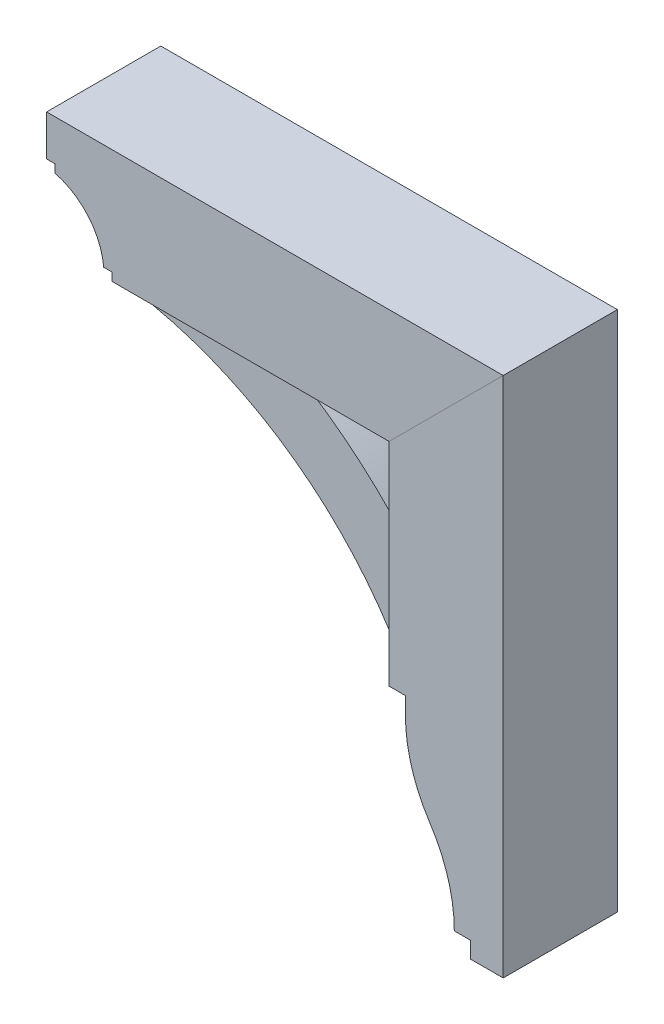
ISO-10303-21;
HEADER;
FILE_DESCRIPTION(('STEP AP214'),'2;1');
FILE_NAME('part.step','',(''),(''),'','','');
FILE_SCHEMA(('AUTOMOTIVE_DESIGN { 1 0 10303 214 1 1 1 1 }'));
ENDSEC;
DATA;
#1=APPLICATION_CONTEXT('core data for automotive mechanical design processes');
#2=APPLICATION_PROTOCOL_DEFINITION('international standard','automotive_design',2000,#1);
#3=PRODUCT_CONTEXT('',#1,'mechanical');
#4=PRODUCT('Part','Part','',(#3));
#5=PRODUCT_RELATED_PRODUCT_CATEGORY('part','',(#4));
#6=PRODUCT_DEFINITION_FORMATION('','',#4);
#7=PRODUCT_DEFINITION_CONTEXT('part definition',#1,'design');
#8=PRODUCT_DEFINITION('design','',#6,#7);
#9=PRODUCT_DEFINITION_SHAPE('','',#8);
#10=(LENGTH_UNIT() NAMED_UNIT(*) SI_UNIT(.MILLI.,.METRE.));
#11=(NAMED_UNIT(*) PLANE_ANGLE_UNIT() SI_UNIT($,.RADIAN.));
#12=(NAMED_UNIT(*) SI_UNIT($,.STERADIAN.) SOLID_ANGLE_UNIT());
#13=UNCERTAINTY_MEASURE_WITH_UNIT(LENGTH_MEASURE(1.E-05),#10,'distance_accuracy_value','');
#14=(GEOMETRIC_REPRESENTATION_CONTEXT(3) GLOBAL_UNCERTAINTY_ASSIGNED_CONTEXT((#13)) GLOBAL_UNIT_ASSIGNED_CONTEXT((#10,
#11,#12)) REPRESENTATION_CONTEXT('',''));
#15=CARTESIAN_POINT('',(0.,0.,0.));
#16=DIRECTION('',(0.,0.,1.));
#17=DIRECTION('',(1.,0.,0.));
#18=AXIS2_PLACEMENT_3D('',#15,#16,#17);
#19=CARTESIAN_POINT('',(246.881223015557,-1.07910715802949E-12,44.45));
#20=DIRECTION('',(1.,0.,0.));
#21=DIRECTION('',(0.,1.,0.));
#22=AXIS2_PLACEMENT_3D('',#19,#20,#21);
#23=PLANE('',#22);
#24=DIRECTION('',(0.,-1.,0.));
#25=VECTOR('',#24,1.);
#26=CARTESIAN_POINT('',(246.881223015557,-1.07910715802949E-12,-44.45));
#27=LINE('',#26,#25);
#28=CARTESIAN_POINT('',(246.881223015556,-183.515,-44.45));
#29=VERTEX_POINT('',#28);
#30=CARTESIAN_POINT('',(246.881223015556,-196.215,-44.45));
#31=VERTEX_POINT('',#30);
#32=EDGE_CURVE('E170',#29,#31,#27,.T.);
#33=ORIENTED_EDGE('',*,*,#32,.T.);
#34=DIRECTION('',(0.,0.,-1.));
#35=VECTOR('',#34,1.);
#36=CARTESIAN_POINT('',(246.881223015556,-196.215,44.45));
#37=LINE('',#36,#35);
#38=CARTESIAN_POINT('',(246.881223015556,-196.215,44.45));
#39=VERTEX_POINT('',#38);
#40=EDGE_CURVE('E12',#39,#31,#37,.T.);
#41=ORIENTED_EDGE('',*,*,#40,.F.);
#42=DIRECTION('',(0.,-1.,0.));
#43=VECTOR('',#42,1.);
#44=CARTESIAN_POINT('',(246.881223015557,-1.07910715802949E-12,44.45));
#45=LINE('',#44,#43);
#46=CARTESIAN_POINT('',(246.881223015556,-183.515,44.45));
#47=VERTEX_POINT('',#46);
#48=EDGE_CURVE('E203',#47,#39,#45,.T.);
#49=ORIENTED_EDGE('',*,*,#48,.F.);
#50=DIRECTION('',(0.,0.,-1.));
#51=VECTOR('',#50,1.);
#52=CARTESIAN_POINT('',(246.881223015556,-183.515,44.45));
#53=LINE('',#52,#51);
#54=EDGE_CURVE('E166',#47,#29,#53,.T.);
#55=ORIENTED_EDGE('',*,*,#54,.T.);
#56=EDGE_LOOP('',(#33,#41,#49,#55));
#57=FACE_BOUND('',#56,.T.);
#58=ADVANCED_FACE('F56',(#57),#23,.F.);
#59=CARTESIAN_POINT('',(362.768723015556,-196.215,44.45));
#60=DIRECTION('',(0.,0.,-1.));
#61=DIRECTION('',(-1.,0.,0.));
#62=AXIS2_PLACEMENT_3D('',#59,#60,#61);
#63=CYLINDRICAL_SURFACE('',#62,115.8875);
#64=CARTESIAN_POINT('',(362.768723015556,-196.215,-44.45));
#65=DIRECTION('',(0.,0.,1.));
#66=DIRECTION('',(1.,0.,0.));
#67=AXIS2_PLACEMENT_3D('',#64,#65,#66);
#68=CIRCLE('',#67,115.8875);
#69=CARTESIAN_POINT('',(266.018608336656,-260.006284403668,-44.45));
#70=VERTEX_POINT('',#69);
#71=EDGE_CURVE('E174',#31,#70,#68,.T.);
#72=ORIENTED_EDGE('',*,*,#71,.T.);
#73=DIRECTION('',(0.,0.,-1.));
#74=VECTOR('',#73,1.);
#75=CARTESIAN_POINT('',(266.018608336656,-260.006284403668,44.45));
#76=LINE('',#75,#74);
#77=CARTESIAN_POINT('',(266.018608336656,-260.006284403668,44.45));
#78=VERTEX_POINT('',#77);
#79=EDGE_CURVE('E65',#78,#70,#76,.T.);
#80=ORIENTED_EDGE('',*,*,#79,.F.);
#81=CARTESIAN_POINT('',(362.768723015556,-196.215,44.45));
#82=DIRECTION('',(0.,0.,1.));
#83=DIRECTION('',(1.,0.,0.));
#84=AXIS2_PLACEMENT_3D('',#81,#82,#83);
#85=CIRCLE('',#84,115.8875);
#86=EDGE_CURVE('E122',#39,#78,#85,.T.);
#87=ORIENTED_EDGE('',*,*,#86,.F.);
#88=ORIENTED_EDGE('',*,*,#40,.T.);
#89=EDGE_LOOP('',(#72,#80,#87,#88));
#90=FACE_BOUND('',#89,.T.);
#91=ADVANCED_FACE('F228',(#90),#63,.T.);
#92=CARTESIAN_POINT('',(170.152056348882,-323.215,44.45));
#93=DIRECTION('',(0.,0.,-1.));
#94=DIRECTION('',(-1.,0.,0.));
#95=AXIS2_PLACEMENT_3D('',#92,#93,#94);
#96=CYLINDRICAL_SURFACE('',#95,114.829166666673);
#97=CARTESIAN_POINT('',(170.152056348882,-323.215,-44.45));
#98=DIRECTION('',(0.,0.,1.));
#99=DIRECTION('',(1.,0.,0.));
#100=AXIS2_PLACEMENT_3D('',#97,#98,#99);
#101=CIRCLE('',#100,114.829166666673);
#102=CARTESIAN_POINT('',(284.981223015555,-323.215,-44.45));
#103=VERTEX_POINT('',#102);
#104=EDGE_CURVE('E178',#103,#70,#101,.T.);
#105=ORIENTED_EDGE('',*,*,#104,.F.);
#106=DIRECTION('',(0.,0.,-1.));
#107=VECTOR('',#106,1.);
#108=CARTESIAN_POINT('',(284.981223015555,-323.215,44.45));
#109=LINE('',#108,#107);
#110=CARTESIAN_POINT('',(284.981223015555,-323.215,44.45));
#111=VERTEX_POINT('',#110);
#112=EDGE_CURVE('E219',#111,#103,#109,.T.);
#113=ORIENTED_EDGE('',*,*,#112,.F.);
#114=CARTESIAN_POINT('',(170.152056348882,-323.215,44.45));
#115=DIRECTION('',(0.,0.,1.));
#116=DIRECTION('',(1.,0.,0.));
#117=AXIS2_PLACEMENT_3D('',#114,#115,#116);
#118=CIRCLE('',#117,114.829166666673);
#119=EDGE_CURVE('E227',#111,#78,#118,.T.);
#120=ORIENTED_EDGE('',*,*,#119,.T.);
#121=ORIENTED_EDGE('',*,*,#79,.T.);
#122=EDGE_LOOP('',(#105,#113,#120,#121));
#123=FACE_BOUND('',#122,.T.);
#124=ADVANCED_FACE('F225',(#123),#96,.F.);
#125=CARTESIAN_POINT('',(0.,-323.215,44.45));
#126=DIRECTION('',(0.,-1.,0.));
#127=DIRECTION('',(0.,0.,-1.));
#128=AXIS2_PLACEMENT_3D('',#125,#126,#127);
#129=PLANE('',#128);
#130=DIRECTION('',(-1.,0.,0.));
#131=VECTOR('',#130,1.);
#132=CARTESIAN_POINT('',(0.,-323.215,-44.45));
#133=LINE('',#132,#131);
#134=CARTESIAN_POINT('',(297.681223015555,-323.215,-44.45));
#135=VERTEX_POINT('',#134);
#136=EDGE_CURVE('E182',#135,#103,#133,.T.);
#137=ORIENTED_EDGE('',*,*,#136,.F.);
#138=DIRECTION('',(0.,0.,-1.));
#139=VECTOR('',#138,1.);
#140=CARTESIAN_POINT('',(297.681223015555,-323.215,44.45));
#141=LINE('',#140,#139);
#142=CARTESIAN_POINT('',(297.681223015555,-323.215,44.45));
#143=VERTEX_POINT('',#142);
#144=EDGE_CURVE('E216',#143,#135,#141,.T.);
#145=ORIENTED_EDGE('',*,*,#144,.F.);
#146=DIRECTION('',(-1.,0.,0.));
#147=VECTOR('',#146,1.);
#148=CARTESIAN_POINT('',(0.,-323.215,44.45));
#149=LINE('',#148,#147);
#150=EDGE_CURVE('E239',#143,#111,#149,.T.);
#151=ORIENTED_EDGE('',*,*,#150,.T.);
#152=ORIENTED_EDGE('',*,*,#112,.T.);
#153=EDGE_LOOP('',(#137,#145,#151,#152));
#154=FACE_BOUND('',#153,.T.);
#155=ADVANCED_FACE('F236',(#154),#129,.T.);
#156=CARTESIAN_POINT('',(297.681223015555,0.,44.45));
#157=DIRECTION('',(-1.,0.,0.));
#158=DIRECTION('',(0.,0.,1.));
#159=AXIS2_PLACEMENT_3D('',#156,#157,#158);
#160=PLANE('',#159);
#161=DIRECTION('',(0.,1.,0.));
#162=VECTOR('',#161,1.);
#163=CARTESIAN_POINT('',(297.681223015555,0.,-44.45));
#164=LINE('',#163,#162);
#165=CARTESIAN_POINT('',(297.681223015555,-335.915,-44.45));
#166=VERTEX_POINT('',#165);
#167=EDGE_CURVE('E186',#166,#135,#164,.T.);
#168=ORIENTED_EDGE('',*,*,#167,.F.);
#169=DIRECTION('',(0.,0.,-1.));
#170=VECTOR('',#169,1.);
#171=CARTESIAN_POINT('',(297.681223015555,-335.915,44.45));
#172=LINE('',#171,#170);
#173=CARTESIAN_POINT('',(297.681223015555,-335.915,44.45));
#174=VERTEX_POINT('',#173);
#175=EDGE_CURVE('E213',#174,#166,#172,.T.);
#176=ORIENTED_EDGE('',*,*,#175,.F.);
#177=DIRECTION('',(0.,1.,0.));
#178=VECTOR('',#177,1.);
#179=CARTESIAN_POINT('',(297.681223015555,0.,44.45));
#180=LINE('',#179,#178);
#181=EDGE_CURVE('E246',#174,#143,#180,.T.);
#182=ORIENTED_EDGE('',*,*,#181,.T.);
#183=ORIENTED_EDGE('',*,*,#144,.T.);
#184=EDGE_LOOP('',(#168,#176,#182,#183));
#185=FACE_BOUND('',#184,.T.);
#186=ADVANCED_FACE('F261',(#185),#160,.T.);
#187=CARTESIAN_POINT('',(7.34134975033387E-13,-335.915000000001,44.45));
#188=DIRECTION('',(0.,-1.,0.));
#189=DIRECTION('',(1.,0.,0.));
#190=AXIS2_PLACEMENT_3D('',#187,#188,#189);
#191=PLANE('',#190);
#192=DIRECTION('',(-1.,0.,0.));
#193=VECTOR('',#192,1.);
#194=CARTESIAN_POINT('',(7.34134975033387E-13,-335.915000000001,-44.45));
#195=LINE('',#194,#193);
#196=CARTESIAN_POINT('',(323.081223015555,-335.915,-44.45));
#197=VERTEX_POINT('',#196);
#198=EDGE_CURVE('E190',#197,#166,#195,.T.);
#199=ORIENTED_EDGE('',*,*,#198,.F.);
#200=DIRECTION('',(0.,0.,-1.));
#201=VECTOR('',#200,1.);
#202=CARTESIAN_POINT('',(323.081223015555,-335.915,44.45));
#203=LINE('',#202,#201);
#204=CARTESIAN_POINT('',(323.081223015555,-335.915,44.45));
#205=VERTEX_POINT('',#204);
#206=EDGE_CURVE('E210',#205,#197,#203,.T.);
#207=ORIENTED_EDGE('',*,*,#206,.F.);
#208=DIRECTION('',(-1.,0.,0.));
#209=VECTOR('',#208,1.);
#210=CARTESIAN_POINT('',(7.34134975033387E-13,-335.915000000001,44.45));
#211=LINE('',#210,#209);
#212=EDGE_CURVE('E253',#205,#174,#211,.T.);
#213=ORIENTED_EDGE('',*,*,#212,.T.);
#214=ORIENTED_EDGE('',*,*,#175,.T.);
#215=EDGE_LOOP('',(#199,#207,#213,#214));
#216=FACE_BOUND('',#215,.T.);
#217=ADVANCED_FACE('F259',(#216),#191,.T.);
#218=CARTESIAN_POINT('',(323.081223015555,0.,44.45));
#219=DIRECTION('',(-1.,0.,0.));
#220=DIRECTION('',(0.,0.,1.));
#221=AXIS2_PLACEMENT_3D('',#218,#219,#220);
#222=PLANE('',#221);
#223=DIRECTION('',(0.,1.,0.));
#224=VECTOR('',#223,1.);
#225=CARTESIAN_POINT('',(323.081223015555,0.,-44.45));
#226=LINE('',#225,#224);
#227=CARTESIAN_POINT('',(323.081223015555,70.485,-44.45));
#228=VERTEX_POINT('',#227);
#229=EDGE_CURVE('E194',#197,#228,#226,.T.);
#230=ORIENTED_EDGE('',*,*,#229,.T.);
#231=DIRECTION('',(0.,0.,-1.));
#232=VECTOR('',#231,1.);
#233=CARTESIAN_POINT('',(323.081223015555,70.485,44.45));
#234=LINE('',#233,#232);
#235=CARTESIAN_POINT('',(323.081223015555,70.485,44.45));
#236=VERTEX_POINT('',#235);
#237=EDGE_CURVE('E159',#236,#228,#234,.T.);
#238=ORIENTED_EDGE('',*,*,#237,.F.);
#239=DIRECTION('',(0.,1.,0.));
#240=VECTOR('',#239,1.);
#241=CARTESIAN_POINT('',(323.081223015555,0.,44.45));
#242=LINE('',#241,#240);
#243=EDGE_CURVE('E148',#205,#236,#242,.T.);
#244=ORIENTED_EDGE('',*,*,#243,.F.);
#245=ORIENTED_EDGE('',*,*,#206,.T.);
#246=EDGE_LOOP('',(#230,#238,#244,#245));
#247=FACE_BOUND('',#246,.T.);
#248=ADVANCED_FACE('F264',(#247),#222,.F.);
#249=CARTESIAN_POINT('',(126.29811150778,-126.298111507778,44.45));
#250=DIRECTION('',(0.707106781186552,-0.707106781186543,0.));
#251=DIRECTION('',(0.707106781186543,0.707106781186552,0.));
#252=AXIS2_PLACEMENT_3D('',#249,#250,#251);
#253=PLANE('',#252);
#254=DIRECTION('',(-0.707106781186543,-0.707106781186552,0.));
#255=VECTOR('',#254,1.);
#256=CARTESIAN_POINT('',(126.29811150778,-126.298111507778,-44.45));
#257=LINE('',#256,#255);
#258=CARTESIAN_POINT('',(234.181223015556,-18.4150000000001,-44.45));
#259=VERTEX_POINT('',#258);
#260=EDGE_CURVE('E157',#228,#259,#257,.T.);
#261=ORIENTED_EDGE('',*,*,#260,.T.);
#262=DIRECTION('',(0.,0.,-1.));
#263=VECTOR('',#262,1.);
#264=CARTESIAN_POINT('',(234.181223015556,-18.4150000000001,44.45));
#265=LINE('',#264,#263);
#266=CARTESIAN_POINT('',(234.181223015556,-18.4150000000001,44.45));
#267=VERTEX_POINT('',#266);
#268=EDGE_CURVE('E154',#267,#259,#265,.T.);
#269=ORIENTED_EDGE('',*,*,#268,.F.);
#270=DIRECTION('',(-0.707106781186543,-0.707106781186552,0.));
#271=VECTOR('',#270,1.);
#272=CARTESIAN_POINT('',(126.29811150778,-126.298111507778,44.45));
#273=LINE('',#272,#271);
#274=EDGE_CURVE('E141',#236,#267,#273,.T.);
#275=ORIENTED_EDGE('',*,*,#274,.F.);
#276=ORIENTED_EDGE('',*,*,#237,.T.);
#277=EDGE_LOOP('',(#261,#269,#275,#276));
#278=FACE_BOUND('',#277,.T.);
#279=ADVANCED_FACE('F155',(#278),#253,.F.);
#280=CARTESIAN_POINT('',(234.181223015556,1.18107231553641E-13,44.45));
#281=DIRECTION('',(1.,0.,0.));
#282=DIRECTION('',(0.,1.,0.));
#283=AXIS2_PLACEMENT_3D('',#280,#281,#282);
#284=PLANE('',#283);
#285=DIRECTION('',(0.,-1.,0.));
#286=VECTOR('',#285,1.);
#287=CARTESIAN_POINT('',(234.181223015556,1.18107231553641E-13,-44.45));
#288=LINE('',#287,#286);
#289=CARTESIAN_POINT('',(234.181223015556,-183.515,-44.45));
#290=VERTEX_POINT('',#289);
#291=EDGE_CURVE('E108',#259,#290,#288,.T.);
#292=ORIENTED_EDGE('',*,*,#291,.T.);
#293=DIRECTION('',(0.,0.,-1.));
#294=VECTOR('',#293,1.);
#295=CARTESIAN_POINT('',(234.181223015556,-183.515,44.45));
#296=LINE('',#295,#294);
#297=CARTESIAN_POINT('',(234.181223015556,-183.515,44.45));
#298=VERTEX_POINT('',#297);
#299=EDGE_CURVE('E160',#298,#290,#296,.T.);
#300=ORIENTED_EDGE('',*,*,#299,.F.);
#301=DIRECTION('',(0.,-1.,0.));
#302=VECTOR('',#301,1.);
#303=CARTESIAN_POINT('',(234.181223015556,1.18107231553641E-13,44.45));
#304=LINE('',#303,#302);
#305=EDGE_CURVE('E145',#267,#298,#304,.T.);
#306=ORIENTED_EDGE('',*,*,#305,.F.);
#307=ORIENTED_EDGE('',*,*,#268,.T.);
#308=EDGE_LOOP('',(#292,#300,#306,#307));
#309=FACE_BOUND('',#308,.T.);
#310=ADVANCED_FACE('F162',(#309),#284,.F.);
#311=CARTESIAN_POINT('',(0.,-183.515,44.45));
#312=DIRECTION('',(0.,1.,0.));
#313=DIRECTION('',(0.,0.,1.));
#314=AXIS2_PLACEMENT_3D('',#311,#312,#313);
#315=PLANE('',#314);
#316=DIRECTION('',(1.,0.,0.));
#317=VECTOR('',#316,1.);
#318=CARTESIAN_POINT('',(0.,-183.515,-44.45));
#319=LINE('',#318,#317);
#320=EDGE_CURVE('E114',#290,#29,#319,.T.);
#321=ORIENTED_EDGE('',*,*,#320,.T.);
#322=ORIENTED_EDGE('',*,*,#54,.F.);
#323=DIRECTION('',(1.,0.,0.));
#324=VECTOR('',#323,1.);
#325=CARTESIAN_POINT('',(0.,-183.515,44.45));
#326=LINE('',#325,#324);
#327=EDGE_CURVE('E73',#298,#47,#326,.T.);
#328=ORIENTED_EDGE('',*,*,#327,.F.);
#329=ORIENTED_EDGE('',*,*,#299,.T.);
#330=EDGE_LOOP('',(#321,#322,#328,#329));
#331=FACE_BOUND('',#330,.T.);
#332=ADVANCED_FACE('F279',(#331),#315,.F.);
#333=CARTESIAN_POINT('',(0.,0.,44.45));
#334=DIRECTION('',(0.,0.,1.));
#335=DIRECTION('',(1.,0.,0.));
#336=AXIS2_PLACEMENT_3D('',#333,#334,#335);
#337=PLANE('',#336);
#338=ORIENTED_EDGE('',*,*,#48,.T.);
#339=ORIENTED_EDGE('',*,*,#86,.T.);
#340=ORIENTED_EDGE('',*,*,#119,.F.);
#341=ORIENTED_EDGE('',*,*,#150,.F.);
#342=ORIENTED_EDGE('',*,*,#181,.F.);
#343=ORIENTED_EDGE('',*,*,#212,.F.);
#344=ORIENTED_EDGE('',*,*,#243,.T.);
#345=ORIENTED_EDGE('',*,*,#274,.T.);
#346=ORIENTED_EDGE('',*,*,#305,.T.);
#347=ORIENTED_EDGE('',*,*,#327,.T.);
#348=EDGE_LOOP('',(#338,#339,#340,#341,#342,#343,#344,#345,#346,#347));
#349=FACE_BOUND('',#348,.T.);
#350=ADVANCED_FACE('F143',(#349),#337,.T.);
#351=CARTESIAN_POINT('',(0.,0.,-44.45));
#352=DIRECTION('',(0.,0.,1.));
#353=DIRECTION('',(1.,0.,0.));
#354=AXIS2_PLACEMENT_3D('',#351,#352,#353);
#355=PLANE('',#354);
#356=ORIENTED_EDGE('',*,*,#32,.F.);
#357=ORIENTED_EDGE('',*,*,#320,.F.);
#358=ORIENTED_EDGE('',*,*,#291,.F.);
#359=ORIENTED_EDGE('',*,*,#260,.F.);
#360=ORIENTED_EDGE('',*,*,#229,.F.);
#361=ORIENTED_EDGE('',*,*,#198,.T.);
#362=ORIENTED_EDGE('',*,*,#167,.T.);
#363=ORIENTED_EDGE('',*,*,#136,.T.);
#364=ORIENTED_EDGE('',*,*,#104,.T.);
#365=ORIENTED_EDGE('',*,*,#71,.F.);
#366=EDGE_LOOP('',(#356,#357,#358,#359,#360,#361,#362,#363,#364,#365));
#367=FACE_BOUND('',#366,.T.);
#368=ADVANCED_FACE('F232',(#367),#355,.F.);
#369=CLOSED_SHELL('',(#58,#91,#124,#155,#186,#217,#248,#279,#310,#332,#350,#368));
#370=MANIFOLD_SOLID_BREP('B2',#369);
#371=CARTESIAN_POINT('',(-24.836470243147,-316.140343967117,31.75));
#372=DIRECTION('',(0.,0.,-1.));
#373=DIRECTION('',(-1.,0.,0.));
#374=AXIS2_PLACEMENT_3D('',#371,#372,#373);
#375=CYLINDRICAL_SURFACE('',#374,342.9);
#376=CARTESIAN_POINT('',(-24.836470243147,-316.140343967117,-31.75));
#377=DIRECTION('',(0.,0.,1.));
#378=DIRECTION('',(1.,0.,0.));
#379=AXIS2_PLACEMENT_3D('',#376,#377,#378);
#380=CIRCLE('',#379,342.9);
#381=CARTESIAN_POINT('',(145.281223015556,-18.4150000000001,-31.75));
#382=VERTEX_POINT('',#381);
#383=CARTESIAN_POINT('',(234.181223015556,-91.4400000000003,-31.75));
#384=VERTEX_POINT('',#383);
#385=EDGE_CURVE('E469',#382,#384,#380,.F.);
#386=ORIENTED_EDGE('',*,*,#385,.F.);
#387=DIRECTION('',(0.,0.,-1.));
#388=VECTOR('',#387,1.);
#389=CARTESIAN_POINT('',(145.281223015556,-18.4150000000001,31.75));
#390=LINE('',#389,#388);
#391=CARTESIAN_POINT('',(145.281223015556,-18.4150000000001,31.75));
#392=VERTEX_POINT('',#391);
#393=EDGE_CURVE('E54',#392,#382,#390,.T.);
#394=ORIENTED_EDGE('',*,*,#393,.F.);
#395=CARTESIAN_POINT('',(-24.836470243147,-316.140343967117,31.75));
#396=DIRECTION('',(0.,0.,1.));
#397=DIRECTION('',(1.,0.,0.));
#398=AXIS2_PLACEMENT_3D('',#395,#396,#397);
#399=CIRCLE('',#398,342.9);
#400=CARTESIAN_POINT('',(234.181223015556,-91.4400000000003,31.75));
#401=VERTEX_POINT('',#400);
#402=EDGE_CURVE('E482',#392,#401,#399,.F.);
#403=ORIENTED_EDGE('',*,*,#402,.T.);
#404=DIRECTION('',(0.,0.,-1.));
#405=VECTOR('',#404,1.);
#406=CARTESIAN_POINT('',(234.181223015556,-91.4400000000003,31.75));
#407=LINE('',#406,#405);
#408=EDGE_CURVE('E403',#401,#384,#407,.T.);
#409=ORIENTED_EDGE('',*,*,#408,.T.);
#410=EDGE_LOOP('',(#386,#394,#403,#409));
#411=FACE_BOUND('',#410,.T.);
#412=ADVANCED_FACE('F387',(#411),#375,.T.);
#413=CARTESIAN_POINT('',(0.,-18.4150000000002,31.75));
#414=DIRECTION('',(0.,1.,0.));
#415=DIRECTION('',(-1.,0.,0.));
#416=AXIS2_PLACEMENT_3D('',#413,#414,#415);
#417=PLANE('',#416);
#418=DIRECTION('',(1.,0.,0.));
#419=VECTOR('',#418,1.);
#420=CARTESIAN_POINT('',(0.,-18.4150000000002,-31.75));
#421=LINE('',#420,#419);
#422=CARTESIAN_POINT('',(37.3312230155549,-18.4150000000002,-31.75));
#423=VERTEX_POINT('',#422);
#424=EDGE_CURVE('E471',#423,#382,#421,.T.);
#425=ORIENTED_EDGE('',*,*,#424,.F.);
#426=DIRECTION('',(0.,0.,-1.));
#427=VECTOR('',#426,1.);
#428=CARTESIAN_POINT('',(37.3312230155549,-18.4150000000002,31.75));
#429=LINE('',#428,#427);
#430=CARTESIAN_POINT('',(37.3312230155549,-18.4150000000002,31.75));
#431=VERTEX_POINT('',#430);
#432=EDGE_CURVE('E395',#431,#423,#429,.T.);
#433=ORIENTED_EDGE('',*,*,#432,.F.);
#434=DIRECTION('',(1.,0.,0.));
#435=VECTOR('',#434,1.);
#436=CARTESIAN_POINT('',(0.,-18.4150000000002,31.75));
#437=LINE('',#436,#435);
#438=EDGE_CURVE('E494',#431,#392,#437,.T.);
#439=ORIENTED_EDGE('',*,*,#438,.T.);
#440=ORIENTED_EDGE('',*,*,#393,.T.);
#441=EDGE_LOOP('',(#425,#433,#439,#440));
#442=FACE_BOUND('',#441,.T.);
#443=ADVANCED_FACE('F493',(#442),#417,.T.);
#444=CARTESIAN_POINT('',(37.3312230155549,0.,31.75));
#445=DIRECTION('',(1.,0.,0.));
#446=DIRECTION('',(0.,1.,0.));
#447=AXIS2_PLACEMENT_3D('',#444,#445,#446);
#448=PLANE('',#447);
#449=DIRECTION('',(0.,-1.,0.));
#450=VECTOR('',#449,1.);
#451=CARTESIAN_POINT('',(37.3312230155549,0.,-31.75));
#452=LINE('',#451,#450);
#453=CARTESIAN_POINT('',(37.3312230155549,-31.1150000000002,-31.75));
#454=VERTEX_POINT('',#453);
#455=EDGE_CURVE('E474',#423,#454,#452,.T.);
#456=ORIENTED_EDGE('',*,*,#455,.T.);
#457=DIRECTION('',(0.,0.,-1.));
#458=VECTOR('',#457,1.);
#459=CARTESIAN_POINT('',(37.3312230155549,-31.1150000000002,31.75));
#460=LINE('',#459,#458);
#461=CARTESIAN_POINT('',(37.3312230155549,-31.1150000000002,31.75));
#462=VERTEX_POINT('',#461);
#463=EDGE_CURVE('E461',#462,#454,#460,.T.);
#464=ORIENTED_EDGE('',*,*,#463,.F.);
#465=DIRECTION('',(0.,-1.,0.));
#466=VECTOR('',#465,1.);
#467=CARTESIAN_POINT('',(37.3312230155549,0.,31.75));
#468=LINE('',#467,#466);
#469=EDGE_CURVE('E449',#431,#462,#468,.T.);
#470=ORIENTED_EDGE('',*,*,#469,.F.);
#471=ORIENTED_EDGE('',*,*,#432,.T.);
#472=EDGE_LOOP('',(#456,#464,#470,#471));
#473=FACE_BOUND('',#472,.T.);
#474=ADVANCED_FACE('F487',(#473),#448,.F.);
#475=CARTESIAN_POINT('',(-23.7895004684736,-316.748799051844,31.75));
#476=DIRECTION('',(0.,0.,-1.));
#477=DIRECTION('',(-1.,0.,0.));
#478=AXIS2_PLACEMENT_3D('',#475,#476,#477);
#479=CYLINDRICAL_SURFACE('',#478,292.1);
#480=CARTESIAN_POINT('',(-23.7895004684736,-316.748799051844,-31.75));
#481=DIRECTION('',(0.,0.,1.));
#482=DIRECTION('',(1.,0.,0.));
#483=AXIS2_PLACEMENT_3D('',#480,#481,#482);
#484=CIRCLE('',#483,292.1);
#485=CARTESIAN_POINT('',(221.481223015556,-158.115,-31.75));
#486=VERTEX_POINT('',#485);
#487=EDGE_CURVE('E458',#454,#486,#484,.F.);
#488=ORIENTED_EDGE('',*,*,#487,.T.);
#489=DIRECTION('',(0.,0.,-1.));
#490=VECTOR('',#489,1.);
#491=CARTESIAN_POINT('',(221.481223015556,-158.115,31.75));
#492=LINE('',#491,#490);
#493=CARTESIAN_POINT('',(221.481223015556,-158.115,31.75));
#494=VERTEX_POINT('',#493);
#495=EDGE_CURVE('E455',#494,#486,#492,.T.);
#496=ORIENTED_EDGE('',*,*,#495,.F.);
#497=CARTESIAN_POINT('',(-23.7895004684736,-316.748799051844,31.75));
#498=DIRECTION('',(0.,0.,1.));
#499=DIRECTION('',(1.,0.,0.));
#500=AXIS2_PLACEMENT_3D('',#497,#498,#499);
#501=CIRCLE('',#500,292.1);
#502=EDGE_CURVE('E441',#462,#494,#501,.F.);
#503=ORIENTED_EDGE('',*,*,#502,.F.);
#504=ORIENTED_EDGE('',*,*,#463,.T.);
#505=EDGE_LOOP('',(#488,#496,#503,#504));
#506=FACE_BOUND('',#505,.T.);
#507=ADVANCED_FACE('F456',(#506),#479,.F.);
#508=CARTESIAN_POINT('',(3.45556916414581E-13,-158.115000000001,31.75));
#509=DIRECTION('',(0.,-1.,0.));
#510=DIRECTION('',(1.,0.,0.));
#511=AXIS2_PLACEMENT_3D('',#508,#509,#510);
#512=PLANE('',#511);
#513=DIRECTION('',(-1.,0.,0.));
#514=VECTOR('',#513,1.);
#515=CARTESIAN_POINT('',(3.45556916414581E-13,-158.115000000001,-31.75));
#516=LINE('',#515,#514);
#517=CARTESIAN_POINT('',(234.181223015556,-158.115,-31.75));
#518=VERTEX_POINT('',#517);
#519=EDGE_CURVE('E477',#518,#486,#516,.T.);
#520=ORIENTED_EDGE('',*,*,#519,.F.);
#521=DIRECTION('',(0.,0.,-1.));
#522=VECTOR('',#521,1.);
#523=CARTESIAN_POINT('',(234.181223015556,-158.115,31.75));
#524=LINE('',#523,#522);
#525=CARTESIAN_POINT('',(234.181223015556,-158.115,31.75));
#526=VERTEX_POINT('',#525);
#527=EDGE_CURVE('E422',#526,#518,#524,.T.);
#528=ORIENTED_EDGE('',*,*,#527,.F.);
#529=DIRECTION('',(-1.,0.,0.));
#530=VECTOR('',#529,1.);
#531=CARTESIAN_POINT('',(3.45556916414581E-13,-158.115000000001,31.75));
#532=LINE('',#531,#530);
#533=EDGE_CURVE('E446',#526,#494,#532,.T.);
#534=ORIENTED_EDGE('',*,*,#533,.T.);
#535=ORIENTED_EDGE('',*,*,#495,.T.);
#536=EDGE_LOOP('',(#520,#528,#534,#535));
#537=FACE_BOUND('',#536,.T.);
#538=ADVANCED_FACE('F463',(#537),#512,.T.);
#539=CARTESIAN_POINT('',(234.181223015556,1.18107231553641E-13,31.75));
#540=DIRECTION('',(1.,0.,0.));
#541=DIRECTION('',(0.,1.,0.));
#542=AXIS2_PLACEMENT_3D('',#539,#540,#541);
#543=PLANE('',#542);
#544=DIRECTION('',(0.,-1.,0.));
#545=VECTOR('',#544,1.);
#546=CARTESIAN_POINT('',(234.181223015556,1.18107231553641E-13,-31.75));
#547=LINE('',#546,#545);
#548=EDGE_CURVE('E479',#384,#518,#547,.T.);
#549=ORIENTED_EDGE('',*,*,#548,.F.);
#550=ORIENTED_EDGE('',*,*,#408,.F.);
#551=DIRECTION('',(0.,-1.,0.));
#552=VECTOR('',#551,1.);
#553=CARTESIAN_POINT('',(234.181223015556,1.18107231553641E-13,31.75));
#554=LINE('',#553,#552);
#555=EDGE_CURVE('E464',#401,#526,#554,.T.);
#556=ORIENTED_EDGE('',*,*,#555,.T.);
#557=ORIENTED_EDGE('',*,*,#527,.T.);
#558=EDGE_LOOP('',(#549,#550,#556,#557));
#559=FACE_BOUND('',#558,.T.);
#560=ADVANCED_FACE('F495',(#559),#543,.T.);
#561=CARTESIAN_POINT('',(0.,0.,31.75));
#562=DIRECTION('',(0.,0.,1.));
#563=DIRECTION('',(1.,0.,0.));
#564=AXIS2_PLACEMENT_3D('',#561,#562,#563);
#565=PLANE('',#564);
#566=ORIENTED_EDGE('',*,*,#402,.F.);
#567=ORIENTED_EDGE('',*,*,#438,.F.);
#568=ORIENTED_EDGE('',*,*,#469,.T.);
#569=ORIENTED_EDGE('',*,*,#502,.T.);
#570=ORIENTED_EDGE('',*,*,#533,.F.);
#571=ORIENTED_EDGE('',*,*,#555,.F.);
#572=EDGE_LOOP('',(#566,#567,#568,#569,#570,#571));
#573=FACE_BOUND('',#572,.T.);
#574=ADVANCED_FACE('F443',(#573),#565,.T.);
#575=CARTESIAN_POINT('',(0.,0.,-31.75));
#576=DIRECTION('',(0.,0.,1.));
#577=DIRECTION('',(1.,0.,0.));
#578=AXIS2_PLACEMENT_3D('',#575,#576,#577);
#579=PLANE('',#578);
#580=ORIENTED_EDGE('',*,*,#385,.T.);
#581=ORIENTED_EDGE('',*,*,#548,.T.);
#582=ORIENTED_EDGE('',*,*,#519,.T.);
#583=ORIENTED_EDGE('',*,*,#487,.F.);
#584=ORIENTED_EDGE('',*,*,#455,.F.);
#585=ORIENTED_EDGE('',*,*,#424,.T.);
#586=EDGE_LOOP('',(#580,#581,#582,#583,#584,#585));
#587=FACE_BOUND('',#586,.T.);
#588=ADVANCED_FACE('F492',(#587),#579,.F.);
#589=CLOSED_SHELL('',(#412,#443,#474,#507,#538,#560,#574,#588));
#590=MANIFOLD_SOLID_BREP('B6',#589);
#591=CARTESIAN_POINT('',(-26.1687769844454,2.00169538524493E-13,44.45));
#592=DIRECTION('',(-1.,0.,0.));
#593=DIRECTION('',(0.,-1.,0.));
#594=AXIS2_PLACEMENT_3D('',#591,#592,#593);
#595=PLANE('',#594);
#596=DIRECTION('',(0.,1.,0.));
#597=VECTOR('',#596,1.);
#598=CARTESIAN_POINT('',(-26.1687769844454,2.00169538524493E-13,-44.45));
#599=LINE('',#598,#597);
#600=CARTESIAN_POINT('',(-26.1687769844451,32.3849999999999,-44.45));
#601=VERTEX_POINT('',#600);
#602=CARTESIAN_POINT('',(-26.1687769844451,38.735,-44.45));
#603=VERTEX_POINT('',#602);
#604=EDGE_CURVE('E670',#601,#603,#599,.T.);
#605=ORIENTED_EDGE('',*,*,#604,.F.);
#606=DIRECTION('',(0.,0.,-1.));
#607=VECTOR('',#606,1.);
#608=CARTESIAN_POINT('',(-26.1687769844451,32.3849999999999,44.45));
#609=LINE('',#608,#607);
#610=CARTESIAN_POINT('',(-26.1687769844451,32.3849999999999,44.45));
#611=VERTEX_POINT('',#610);
#612=EDGE_CURVE('E385',#611,#601,#609,.T.);
#613=ORIENTED_EDGE('',*,*,#612,.F.);
#614=DIRECTION('',(0.,1.,0.));
#615=VECTOR('',#614,1.);
#616=CARTESIAN_POINT('',(-26.1687769844454,2.00169538524493E-13,44.45));
#617=LINE('',#616,#615);
#618=CARTESIAN_POINT('',(-26.1687769844451,38.735,44.45));
#619=VERTEX_POINT('',#618);
#620=EDGE_CURVE('E693',#611,#619,#617,.T.);
#621=ORIENTED_EDGE('',*,*,#620,.T.);
#622=DIRECTION('',(0.,0.,-1.));
#623=VECTOR('',#622,1.);
#624=CARTESIAN_POINT('',(-26.1687769844451,38.735,44.45));
#625=LINE('',#624,#623);
#626=EDGE_CURVE('E587',#619,#603,#625,.T.);
#627=ORIENTED_EDGE('',*,*,#626,.T.);
#628=EDGE_LOOP('',(#605,#613,#621,#627));
#629=FACE_BOUND('',#628,.T.);
#630=ADVANCED_FACE('F571',(#629),#595,.T.);
#631=CARTESIAN_POINT('',(-38.5801017368837,-16.8068497878046,44.45));
#632=DIRECTION('',(0.,0.,-1.));
#633=DIRECTION('',(-1.,0.,0.));
#634=AXIS2_PLACEMENT_3D('',#631,#632,#633);
#635=CYLINDRICAL_SURFACE('',#634,50.7334117486338);
#636=CARTESIAN_POINT('',(-38.5801017368837,-16.8068497878046,-44.45));
#637=DIRECTION('',(0.,0.,1.));
#638=DIRECTION('',(1.,0.,0.));
#639=AXIS2_PLACEMENT_3D('',#636,#637,#638);
#640=CIRCLE('',#639,50.7334117486338);
#641=CARTESIAN_POINT('',(11.9312230155549,-12.0650000000002,-44.45));
#642=VERTEX_POINT('',#641);
#643=EDGE_CURVE('E672',#601,#642,#640,.F.);
#644=ORIENTED_EDGE('',*,*,#643,.T.);
#645=DIRECTION('',(0.,0.,-1.));
#646=VECTOR('',#645,1.);
#647=CARTESIAN_POINT('',(11.9312230155549,-12.0650000000002,44.45));
#648=LINE('',#647,#646);
#649=CARTESIAN_POINT('',(11.9312230155549,-12.0650000000002,44.45));
#650=VERTEX_POINT('',#649);
#651=EDGE_CURVE('E579',#650,#642,#648,.T.);
#652=ORIENTED_EDGE('',*,*,#651,.F.);
#653=CARTESIAN_POINT('',(-38.5801017368837,-16.8068497878046,44.45));
#654=DIRECTION('',(0.,0.,1.));
#655=DIRECTION('',(1.,0.,0.));
#656=AXIS2_PLACEMENT_3D('',#653,#654,#655);
#657=CIRCLE('',#656,50.7334117486338);
#658=EDGE_CURVE('E722',#611,#650,#657,.F.);
#659=ORIENTED_EDGE('',*,*,#658,.F.);
#660=ORIENTED_EDGE('',*,*,#612,.T.);
#661=EDGE_LOOP('',(#644,#652,#659,#660));
#662=FACE_BOUND('',#661,.T.);
#663=ADVANCED_FACE('F711',(#662),#635,.F.);
#664=CARTESIAN_POINT('',(0.,-12.0650000000002,44.45));
#665=DIRECTION('',(0.,-1.,0.));
#666=DIRECTION('',(0.,0.,-1.));
#667=AXIS2_PLACEMENT_3D('',#664,#665,#666);
#668=PLANE('',#667);
#669=DIRECTION('',(-1.,0.,0.));
#670=VECTOR('',#669,1.);
#671=CARTESIAN_POINT('',(0.,-12.0650000000002,-44.45));
#672=LINE('',#671,#670);
#673=CARTESIAN_POINT('',(18.2812230155549,-12.0650000000002,-44.45));
#674=VERTEX_POINT('',#673);
#675=EDGE_CURVE('E675',#674,#642,#672,.T.);
#676=ORIENTED_EDGE('',*,*,#675,.F.);
#677=DIRECTION('',(0.,0.,-1.));
#678=VECTOR('',#677,1.);
#679=CARTESIAN_POINT('',(18.2812230155549,-12.0650000000002,44.45));
#680=LINE('',#679,#678);
#681=CARTESIAN_POINT('',(18.2812230155549,-12.0650000000002,44.45));
#682=VERTEX_POINT('',#681);
#683=EDGE_CURVE('E701',#682,#674,#680,.T.);
#684=ORIENTED_EDGE('',*,*,#683,.F.);
#685=DIRECTION('',(-1.,0.,0.));
#686=VECTOR('',#685,1.);
#687=CARTESIAN_POINT('',(0.,-12.0650000000002,44.45));
#688=LINE('',#687,#686);
#689=EDGE_CURVE('E708',#682,#650,#688,.T.);
#690=ORIENTED_EDGE('',*,*,#689,.T.);
#691=ORIENTED_EDGE('',*,*,#651,.T.);
#692=EDGE_LOOP('',(#676,#684,#690,#691));
#693=FACE_BOUND('',#692,.T.);
#694=ADVANCED_FACE('F706',(#693),#668,.T.);
#695=CARTESIAN_POINT('',(18.2812230155549,0.,44.45));
#696=DIRECTION('',(-1.,0.,0.));
#697=DIRECTION('',(0.,0.,1.));
#698=AXIS2_PLACEMENT_3D('',#695,#696,#697);
#699=PLANE('',#698);
#700=DIRECTION('',(0.,1.,0.));
#701=VECTOR('',#700,1.);
#702=CARTESIAN_POINT('',(18.2812230155549,0.,-44.45));
#703=LINE('',#702,#701);
#704=CARTESIAN_POINT('',(18.2812230155549,-18.4150000000002,-44.45));
#705=VERTEX_POINT('',#704);
#706=EDGE_CURVE('E678',#705,#674,#703,.T.);
#707=ORIENTED_EDGE('',*,*,#706,.F.);
#708=DIRECTION('',(0.,0.,-1.));
#709=VECTOR('',#708,1.);
#710=CARTESIAN_POINT('',(18.2812230155549,-18.4150000000002,44.45));
#711=LINE('',#710,#709);
#712=CARTESIAN_POINT('',(18.2812230155549,-18.4150000000002,44.45));
#713=VERTEX_POINT('',#712);
#714=EDGE_CURVE('E699',#713,#705,#711,.T.);
#715=ORIENTED_EDGE('',*,*,#714,.F.);
#716=DIRECTION('',(0.,1.,0.));
#717=VECTOR('',#716,1.);
#718=CARTESIAN_POINT('',(18.2812230155549,0.,44.45));
#719=LINE('',#718,#717);
#720=EDGE_CURVE('E721',#713,#682,#719,.T.);
#721=ORIENTED_EDGE('',*,*,#720,.T.);
#722=ORIENTED_EDGE('',*,*,#683,.T.);
#723=EDGE_LOOP('',(#707,#715,#721,#722));
#724=FACE_BOUND('',#723,.T.);
#725=ADVANCED_FACE('F717',(#724),#699,.T.);
#726=CARTESIAN_POINT('',(0.,-18.4150000000002,44.45));
#727=DIRECTION('',(0.,1.,0.));
#728=DIRECTION('',(-1.,0.,0.));
#729=AXIS2_PLACEMENT_3D('',#726,#727,#728);
#730=PLANE('',#729);
#731=DIRECTION('',(1.,0.,0.));
#732=VECTOR('',#731,1.);
#733=CARTESIAN_POINT('',(0.,-18.4150000000002,-44.45));
#734=LINE('',#733,#732);
#735=CARTESIAN_POINT('',(234.181223015556,-18.4150000000001,-44.45));
#736=VERTEX_POINT('',#735);
#737=EDGE_CURVE('E681',#705,#736,#734,.T.);
#738=ORIENTED_EDGE('',*,*,#737,.T.);
#739=DIRECTION('',(0.,0.,-1.));
#740=VECTOR('',#739,1.);
#741=CARTESIAN_POINT('',(234.181223015556,-18.4150000000001,44.45));
#742=LINE('',#741,#740);
#743=CARTESIAN_POINT('',(234.181223015556,-18.4150000000001,44.45));
#744=VERTEX_POINT('',#743);
#745=EDGE_CURVE('E697',#744,#736,#742,.T.);
#746=ORIENTED_EDGE('',*,*,#745,.F.);
#747=DIRECTION('',(1.,0.,0.));
#748=VECTOR('',#747,1.);
#749=CARTESIAN_POINT('',(0.,-18.4150000000002,44.45));
#750=LINE('',#749,#748);
#751=EDGE_CURVE('E724',#713,#744,#750,.T.);
#752=ORIENTED_EDGE('',*,*,#751,.F.);
#753=ORIENTED_EDGE('',*,*,#714,.T.);
#754=EDGE_LOOP('',(#738,#746,#752,#753));
#755=FACE_BOUND('',#754,.T.);
#756=ADVANCED_FACE('F754',(#755),#730,.F.);
#757=CARTESIAN_POINT('',(126.29811150778,-126.298111507778,44.45));
#758=DIRECTION('',(0.707106781186552,-0.707106781186543,0.));
#759=DIRECTION('',(0.707106781186543,0.707106781186552,0.));
#760=AXIS2_PLACEMENT_3D('',#757,#758,#759);
#761=PLANE('',#760);
#762=DIRECTION('',(-0.707106781186543,-0.707106781186552,0.));
#763=VECTOR('',#762,1.);
#764=CARTESIAN_POINT('',(126.29811150778,-126.298111507778,-44.45));
#765=LINE('',#764,#763);
#766=CARTESIAN_POINT('',(323.081223015555,70.485,-44.45));
#767=VERTEX_POINT('',#766);
#768=EDGE_CURVE('E684',#767,#736,#765,.T.);
#769=ORIENTED_EDGE('',*,*,#768,.F.);
#770=DIRECTION('',(0.,0.,-1.));
#771=VECTOR('',#770,1.);
#772=CARTESIAN_POINT('',(323.081223015555,70.485,44.45));
#773=LINE('',#772,#771);
#774=CARTESIAN_POINT('',(323.081223015555,70.485,44.45));
#775=VERTEX_POINT('',#774);
#776=EDGE_CURVE('E662',#775,#767,#773,.T.);
#777=ORIENTED_EDGE('',*,*,#776,.F.);
#778=DIRECTION('',(-0.707106781186543,-0.707106781186552,0.));
#779=VECTOR('',#778,1.);
#780=CARTESIAN_POINT('',(126.29811150778,-126.298111507778,44.45));
#781=LINE('',#780,#779);
#782=EDGE_CURVE('E652',#775,#744,#781,.T.);
#783=ORIENTED_EDGE('',*,*,#782,.T.);
#784=ORIENTED_EDGE('',*,*,#745,.T.);
#785=EDGE_LOOP('',(#769,#777,#783,#784));
#786=FACE_BOUND('',#785,.T.);
#787=ADVANCED_FACE('F731',(#786),#761,.T.);
#788=CARTESIAN_POINT('',(0.,70.485,44.45));
#789=DIRECTION('',(0.,-1.,0.));
#790=DIRECTION('',(0.,0.,-1.));
#791=AXIS2_PLACEMENT_3D('',#788,#789,#790);
#792=PLANE('',#791);
#793=DIRECTION('',(-1.,0.,0.));
#794=VECTOR('',#793,1.);
#795=CARTESIAN_POINT('',(0.,70.485,-44.45));
#796=LINE('',#795,#794);
#797=CARTESIAN_POINT('',(-32.5187769844451,70.485,-44.45));
#798=VERTEX_POINT('',#797);
#799=EDGE_CURVE('E659',#767,#798,#796,.T.);
#800=ORIENTED_EDGE('',*,*,#799,.T.);
#801=DIRECTION('',(0.,0.,-1.));
#802=VECTOR('',#801,1.);
#803=CARTESIAN_POINT('',(-32.5187769844451,70.485,44.45));
#804=LINE('',#803,#802);
#805=CARTESIAN_POINT('',(-32.5187769844451,70.485,44.45));
#806=VERTEX_POINT('',#805);
#807=EDGE_CURVE('E656',#806,#798,#804,.T.);
#808=ORIENTED_EDGE('',*,*,#807,.F.);
#809=DIRECTION('',(-1.,0.,0.));
#810=VECTOR('',#809,1.);
#811=CARTESIAN_POINT('',(0.,70.485,44.45));
#812=LINE('',#811,#810);
#813=EDGE_CURVE('E644',#775,#806,#812,.T.);
#814=ORIENTED_EDGE('',*,*,#813,.F.);
#815=ORIENTED_EDGE('',*,*,#776,.T.);
#816=EDGE_LOOP('',(#800,#808,#814,#815));
#817=FACE_BOUND('',#816,.T.);
#818=ADVANCED_FACE('F657',(#817),#792,.F.);
#819=CARTESIAN_POINT('',(-32.5187769844451,0.,44.45));
#820=DIRECTION('',(1.,0.,0.));
#821=DIRECTION('',(0.,0.,-1.));
#822=AXIS2_PLACEMENT_3D('',#819,#820,#821);
#823=PLANE('',#822);
#824=DIRECTION('',(0.,-1.,0.));
#825=VECTOR('',#824,1.);
#826=CARTESIAN_POINT('',(-32.5187769844451,0.,-44.45));
#827=LINE('',#826,#825);
#828=CARTESIAN_POINT('',(-32.5187769844451,38.735,-44.45));
#829=VERTEX_POINT('',#828);
#830=EDGE_CURVE('E688',#798,#829,#827,.T.);
#831=ORIENTED_EDGE('',*,*,#830,.T.);
#832=DIRECTION('',(0.,0.,-1.));
#833=VECTOR('',#832,1.);
#834=CARTESIAN_POINT('',(-32.5187769844451,38.735,44.45));
#835=LINE('',#834,#833);
#836=CARTESIAN_POINT('',(-32.5187769844451,38.735,44.45));
#837=VERTEX_POINT('',#836);
#838=EDGE_CURVE('E616',#837,#829,#835,.T.);
#839=ORIENTED_EDGE('',*,*,#838,.F.);
#840=DIRECTION('',(0.,-1.,0.));
#841=VECTOR('',#840,1.);
#842=CARTESIAN_POINT('',(-32.5187769844451,0.,44.45));
#843=LINE('',#842,#841);
#844=EDGE_CURVE('E650',#806,#837,#843,.T.);
#845=ORIENTED_EDGE('',*,*,#844,.F.);
#846=ORIENTED_EDGE('',*,*,#807,.T.);
#847=EDGE_LOOP('',(#831,#839,#845,#846));
#848=FACE_BOUND('',#847,.T.);
#849=ADVANCED_FACE('F664',(#848),#823,.F.);
#850=CARTESIAN_POINT('',(0.,38.7349999999999,44.45));
#851=DIRECTION('',(0.,-1.,0.));
#852=DIRECTION('',(1.,0.,0.));
#853=AXIS2_PLACEMENT_3D('',#850,#851,#852);
#854=PLANE('',#853);
#855=DIRECTION('',(-1.,0.,0.));
#856=VECTOR('',#855,1.);
#857=CARTESIAN_POINT('',(0.,38.7349999999999,-44.45));
#858=LINE('',#857,#856);
#859=EDGE_CURVE('E690',#603,#829,#858,.T.);
#860=ORIENTED_EDGE('',*,*,#859,.F.);
#861=ORIENTED_EDGE('',*,*,#626,.F.);
#862=DIRECTION('',(-1.,0.,0.));
#863=VECTOR('',#862,1.);
#864=CARTESIAN_POINT('',(0.,38.7349999999999,44.45));
#865=LINE('',#864,#863);
#866=EDGE_CURVE('E665',#619,#837,#865,.T.);
#867=ORIENTED_EDGE('',*,*,#866,.T.);
#868=ORIENTED_EDGE('',*,*,#838,.T.);
#869=EDGE_LOOP('',(#860,#861,#867,#868));
#870=FACE_BOUND('',#869,.T.);
#871=ADVANCED_FACE('F733',(#870),#854,.T.);
#872=CARTESIAN_POINT('',(0.,0.,44.45));
#873=DIRECTION('',(0.,0.,1.));
#874=DIRECTION('',(1.,0.,0.));
#875=AXIS2_PLACEMENT_3D('',#872,#873,#874);
#876=PLANE('',#875);
#877=ORIENTED_EDGE('',*,*,#620,.F.);
#878=ORIENTED_EDGE('',*,*,#658,.T.);
#879=ORIENTED_EDGE('',*,*,#689,.F.);
#880=ORIENTED_EDGE('',*,*,#720,.F.);
#881=ORIENTED_EDGE('',*,*,#751,.T.);
#882=ORIENTED_EDGE('',*,*,#782,.F.);
#883=ORIENTED_EDGE('',*,*,#813,.T.);
#884=ORIENTED_EDGE('',*,*,#844,.T.);
#885=ORIENTED_EDGE('',*,*,#866,.F.);
#886=EDGE_LOOP('',(#877,#878,#879,#880,#881,#882,#883,#884,#885));
#887=FACE_BOUND('',#886,.T.);
#888=ADVANCED_FACE('F647',(#887),#876,.T.);
#889=CARTESIAN_POINT('',(0.,0.,-44.45));
#890=DIRECTION('',(0.,0.,1.));
#891=DIRECTION('',(1.,0.,0.));
#892=AXIS2_PLACEMENT_3D('',#889,#890,#891);
#893=PLANE('',#892);
#894=ORIENTED_EDGE('',*,*,#604,.T.);
#895=ORIENTED_EDGE('',*,*,#859,.T.);
#896=ORIENTED_EDGE('',*,*,#830,.F.);
#897=ORIENTED_EDGE('',*,*,#799,.F.);
#898=ORIENTED_EDGE('',*,*,#768,.T.);
#899=ORIENTED_EDGE('',*,*,#737,.F.);
#900=ORIENTED_EDGE('',*,*,#706,.T.);
#901=ORIENTED_EDGE('',*,*,#675,.T.);
#902=ORIENTED_EDGE('',*,*,#643,.F.);
#903=EDGE_LOOP('',(#894,#895,#896,#897,#898,#899,#900,#901,#902));
#904=FACE_BOUND('',#903,.T.);
#905=ADVANCED_FACE('F713',(#904),#893,.F.);
#906=CLOSED_SHELL('',(#630,#663,#694,#725,#756,#787,#818,#849,#871,#888,#905));
#907=MANIFOLD_SOLID_BREP('B48',#906);
#908=ADVANCED_BREP_SHAPE_REPRESENTATION('',(#18,#370,#590,#907),#14);
#909=SHAPE_DEFINITION_REPRESENTATION(#9,#908);
ENDSEC;
END-ISO-10303-21;
